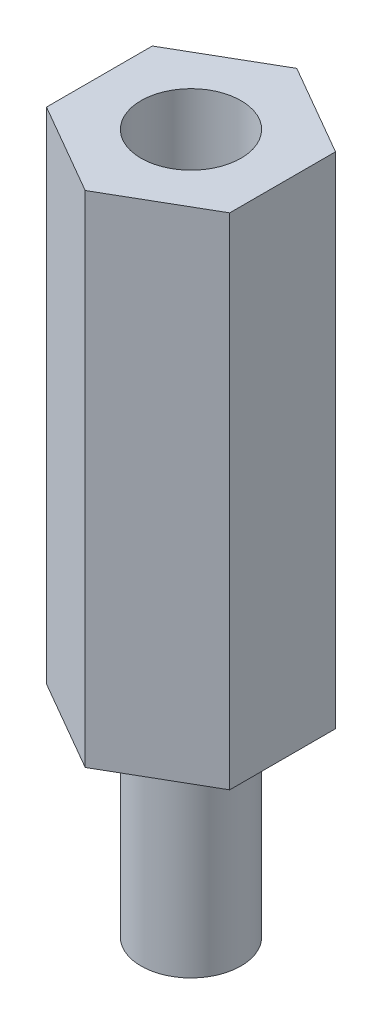
ISO-10303-21;
HEADER;
FILE_DESCRIPTION(('STEP AP214'),'2;1');
FILE_NAME('part.step','',(''),(''),'','','');
FILE_SCHEMA(('AUTOMOTIVE_DESIGN { 1 0 10303 214 1 1 1 1 }'));
ENDSEC;
DATA;
#1=APPLICATION_CONTEXT('core data for automotive mechanical design processes');
#2=APPLICATION_PROTOCOL_DEFINITION('international standard','automotive_design',2000,#1);
#3=PRODUCT_CONTEXT('',#1,'mechanical');
#4=PRODUCT('Part','Part','',(#3));
#5=PRODUCT_RELATED_PRODUCT_CATEGORY('part','',(#4));
#6=PRODUCT_DEFINITION_FORMATION('','',#4);
#7=PRODUCT_DEFINITION_CONTEXT('part definition',#1,'design');
#8=PRODUCT_DEFINITION('design','',#6,#7);
#9=PRODUCT_DEFINITION_SHAPE('','',#8);
#10=(LENGTH_UNIT() NAMED_UNIT(*) SI_UNIT(.MILLI.,.METRE.));
#11=(NAMED_UNIT(*) PLANE_ANGLE_UNIT() SI_UNIT($,.RADIAN.));
#12=(NAMED_UNIT(*) SI_UNIT($,.STERADIAN.) SOLID_ANGLE_UNIT());
#13=UNCERTAINTY_MEASURE_WITH_UNIT(LENGTH_MEASURE(1.E-05),#10,'distance_accuracy_value','');
#14=(GEOMETRIC_REPRESENTATION_CONTEXT(3) GLOBAL_UNCERTAINTY_ASSIGNED_CONTEXT((#13)) GLOBAL_UNIT_ASSIGNED_CONTEXT((#10,
#11,#12)) REPRESENTATION_CONTEXT('',''));
#15=CARTESIAN_POINT('',(0.,0.,0.));
#16=DIRECTION('',(0.,0.,1.));
#17=DIRECTION('',(1.,0.,0.));
#18=AXIS2_PLACEMENT_3D('',#15,#16,#17);
#19=CARTESIAN_POINT('',(2.74999999999998,15.,-1.5877132402715));
#20=DIRECTION('',(-0.499999999999995,0.,0.866025403784441));
#21=DIRECTION('',(0.866025403784441,0.,0.499999999999995));
#22=AXIS2_PLACEMENT_3D('',#19,#20,#21);
#23=PLANE('',#22);
#24=DIRECTION('',(-0.866025403784441,0.,-0.499999999999995));
#25=VECTOR('',#24,1.);
#26=CARTESIAN_POINT('',(2.74999999999998,0.,-1.5877132402715));
#27=LINE('',#26,#25);
#28=CARTESIAN_POINT('',(2.74999999999998,0.,-1.5877132402715));
#29=VERTEX_POINT('',#28);
#30=CARTESIAN_POINT('',(0.,0.,-3.17542648054294));
#31=VERTEX_POINT('',#30);
#32=EDGE_CURVE('E120',#29,#31,#27,.T.);
#33=ORIENTED_EDGE('',*,*,#32,.T.);
#34=DIRECTION('',(0.,-1.,0.));
#35=VECTOR('',#34,1.);
#36=CARTESIAN_POINT('',(0.,15.,-3.17542648054294));
#37=LINE('',#36,#35);
#38=CARTESIAN_POINT('',(0.,15.,-3.17542648054294));
#39=VERTEX_POINT('',#38);
#40=EDGE_CURVE('E37',#39,#31,#37,.T.);
#41=ORIENTED_EDGE('',*,*,#40,.F.);
#42=DIRECTION('',(-0.866025403784441,0.,-0.499999999999995));
#43=VECTOR('',#42,1.);
#44=CARTESIAN_POINT('',(2.74999999999998,15.,-1.5877132402715));
#45=LINE('',#44,#43);
#46=CARTESIAN_POINT('',(2.74999999999998,15.,-1.5877132402715));
#47=VERTEX_POINT('',#46);
#48=EDGE_CURVE('E131',#47,#39,#45,.T.);
#49=ORIENTED_EDGE('',*,*,#48,.F.);
#50=DIRECTION('',(0.,-1.,0.));
#51=VECTOR('',#50,1.);
#52=CARTESIAN_POINT('',(2.74999999999998,15.,-1.5877132402715));
#53=LINE('',#52,#51);
#54=EDGE_CURVE('E116',#47,#29,#53,.T.);
#55=ORIENTED_EDGE('',*,*,#54,.T.);
#56=EDGE_LOOP('',(#33,#41,#49,#55));
#57=FACE_BOUND('',#56,.T.);
#58=ADVANCED_FACE('F34',(#57),#23,.F.);
#59=CARTESIAN_POINT('',(0.,15.,-3.17542648054294));
#60=DIRECTION('',(0.500000000000001,0.,0.866025403784438));
#61=DIRECTION('',(0.866025403784438,0.,-0.500000000000001));
#62=AXIS2_PLACEMENT_3D('',#59,#60,#61);
#63=PLANE('',#62);
#64=DIRECTION('',(-0.866025403784438,0.,0.500000000000001));
#65=VECTOR('',#64,1.);
#66=CARTESIAN_POINT('',(0.,0.,-3.17542648054294));
#67=LINE('',#66,#65);
#68=CARTESIAN_POINT('',(-2.75,0.,-1.58771324027146));
#69=VERTEX_POINT('',#68);
#70=EDGE_CURVE('E123',#31,#69,#67,.T.);
#71=ORIENTED_EDGE('',*,*,#70,.T.);
#72=DIRECTION('',(0.,-1.,0.));
#73=VECTOR('',#72,1.);
#74=CARTESIAN_POINT('',(-2.75,15.,-1.58771324027146));
#75=LINE('',#74,#73);
#76=CARTESIAN_POINT('',(-2.75,15.,-1.58771324027146));
#77=VERTEX_POINT('',#76);
#78=EDGE_CURVE('E134',#77,#69,#75,.T.);
#79=ORIENTED_EDGE('',*,*,#78,.F.);
#80=DIRECTION('',(-0.866025403784438,0.,0.500000000000001));
#81=VECTOR('',#80,1.);
#82=CARTESIAN_POINT('',(0.,15.,-3.17542648054294));
#83=LINE('',#82,#81);
#84=EDGE_CURVE('E89',#39,#77,#83,.T.);
#85=ORIENTED_EDGE('',*,*,#84,.F.);
#86=ORIENTED_EDGE('',*,*,#40,.T.);
#87=EDGE_LOOP('',(#71,#79,#85,#86));
#88=FACE_BOUND('',#87,.T.);
#89=ADVANCED_FACE('F139',(#88),#63,.F.);
#90=CARTESIAN_POINT('',(-2.75,15.,-1.58771324027146));
#91=DIRECTION('',(1.,0.,0.));
#92=DIRECTION('',(0.,0.,-1.));
#93=AXIS2_PLACEMENT_3D('',#90,#91,#92);
#94=PLANE('',#93);
#95=DIRECTION('',(0.,0.,1.));
#96=VECTOR('',#95,1.);
#97=CARTESIAN_POINT('',(-2.75,0.,-1.58771324027146));
#98=LINE('',#97,#96);
#99=CARTESIAN_POINT('',(-2.74999999999999,0.,1.58771324027148));
#100=VERTEX_POINT('',#99);
#101=EDGE_CURVE('E126',#69,#100,#98,.T.);
#102=ORIENTED_EDGE('',*,*,#101,.T.);
#103=DIRECTION('',(0.,-1.,0.));
#104=VECTOR('',#103,1.);
#105=CARTESIAN_POINT('',(-2.74999999999999,15.,1.58771324027148));
#106=LINE('',#105,#104);
#107=CARTESIAN_POINT('',(-2.74999999999999,15.,1.58771324027148));
#108=VERTEX_POINT('',#107);
#109=EDGE_CURVE('E111',#108,#100,#106,.T.);
#110=ORIENTED_EDGE('',*,*,#109,.F.);
#111=DIRECTION('',(0.,0.,1.));
#112=VECTOR('',#111,1.);
#113=CARTESIAN_POINT('',(-2.75,15.,-1.58771324027146));
#114=LINE('',#113,#112);
#115=EDGE_CURVE('E102',#77,#108,#114,.T.);
#116=ORIENTED_EDGE('',*,*,#115,.F.);
#117=ORIENTED_EDGE('',*,*,#78,.T.);
#118=EDGE_LOOP('',(#102,#110,#116,#117));
#119=FACE_BOUND('',#118,.T.);
#120=ADVANCED_FACE('F145',(#119),#94,.F.);
#121=CARTESIAN_POINT('',(-2.74999999999999,15.,1.58771324027148));
#122=DIRECTION('',(0.499999999999995,0.,-0.866025403784442));
#123=DIRECTION('',(-0.866025403784442,0.,-0.499999999999995));
#124=AXIS2_PLACEMENT_3D('',#121,#122,#123);
#125=PLANE('',#124);
#126=DIRECTION('',(0.866025403784442,0.,0.499999999999995));
#127=VECTOR('',#126,1.);
#128=CARTESIAN_POINT('',(-2.74999999999999,0.,1.58771324027148));
#129=LINE('',#128,#127);
#130=CARTESIAN_POINT('',(0.,0.,3.17542648054294));
#131=VERTEX_POINT('',#130);
#132=EDGE_CURVE('E110',#100,#131,#129,.T.);
#133=ORIENTED_EDGE('',*,*,#132,.T.);
#134=DIRECTION('',(0.,-1.,0.));
#135=VECTOR('',#134,1.);
#136=CARTESIAN_POINT('',(0.,15.,3.17542648054294));
#137=LINE('',#136,#135);
#138=CARTESIAN_POINT('',(0.,15.,3.17542648054294));
#139=VERTEX_POINT('',#138);
#140=EDGE_CURVE('E107',#139,#131,#137,.T.);
#141=ORIENTED_EDGE('',*,*,#140,.F.);
#142=DIRECTION('',(0.866025403784442,0.,0.499999999999995));
#143=VECTOR('',#142,1.);
#144=CARTESIAN_POINT('',(-2.74999999999999,15.,1.58771324027148));
#145=LINE('',#144,#143);
#146=EDGE_CURVE('E96',#108,#139,#145,.T.);
#147=ORIENTED_EDGE('',*,*,#146,.F.);
#148=ORIENTED_EDGE('',*,*,#109,.T.);
#149=EDGE_LOOP('',(#133,#141,#147,#148));
#150=FACE_BOUND('',#149,.T.);
#151=ADVANCED_FACE('F108',(#150),#125,.F.);
#152=CARTESIAN_POINT('',(0.,15.,3.17542648054294));
#153=DIRECTION('',(-0.500000000000007,0.,-0.866025403784435));
#154=DIRECTION('',(-0.866025403784435,0.,0.500000000000007));
#155=AXIS2_PLACEMENT_3D('',#152,#153,#154);
#156=PLANE('',#155);
#157=DIRECTION('',(0.866025403784434,0.,-0.500000000000007));
#158=VECTOR('',#157,1.);
#159=CARTESIAN_POINT('',(0.,0.,3.17542648054294));
#160=LINE('',#159,#158);
#161=CARTESIAN_POINT('',(2.75000000000001,0.,1.58771324027144));
#162=VERTEX_POINT('',#161);
#163=EDGE_CURVE('E74',#131,#162,#160,.T.);
#164=ORIENTED_EDGE('',*,*,#163,.T.);
#165=DIRECTION('',(0.,-1.,0.));
#166=VECTOR('',#165,1.);
#167=CARTESIAN_POINT('',(2.75000000000001,15.,1.58771324027144));
#168=LINE('',#167,#166);
#169=CARTESIAN_POINT('',(2.75000000000001,15.,1.58771324027144));
#170=VERTEX_POINT('',#169);
#171=EDGE_CURVE('E112',#170,#162,#168,.T.);
#172=ORIENTED_EDGE('',*,*,#171,.F.);
#173=DIRECTION('',(0.866025403784434,0.,-0.500000000000007));
#174=VECTOR('',#173,1.);
#175=CARTESIAN_POINT('',(0.,15.,3.17542648054294));
#176=LINE('',#175,#174);
#177=EDGE_CURVE('E100',#139,#170,#176,.T.);
#178=ORIENTED_EDGE('',*,*,#177,.F.);
#179=ORIENTED_EDGE('',*,*,#140,.T.);
#180=EDGE_LOOP('',(#164,#172,#178,#179));
#181=FACE_BOUND('',#180,.T.);
#182=ADVANCED_FACE('F114',(#181),#156,.F.);
#183=CARTESIAN_POINT('',(2.75000000000001,15.,1.58771324027144));
#184=DIRECTION('',(-1.,0.,0.));
#185=DIRECTION('',(0.,0.,1.));
#186=AXIS2_PLACEMENT_3D('',#183,#184,#185);
#187=PLANE('',#186);
#188=DIRECTION('',(0.,0.,-1.));
#189=VECTOR('',#188,1.);
#190=CARTESIAN_POINT('',(2.75000000000001,0.,1.58771324027144));
#191=LINE('',#190,#189);
#192=EDGE_CURVE('E80',#162,#29,#191,.T.);
#193=ORIENTED_EDGE('',*,*,#192,.T.);
#194=ORIENTED_EDGE('',*,*,#54,.F.);
#195=DIRECTION('',(0.,0.,-1.));
#196=VECTOR('',#195,1.);
#197=CARTESIAN_POINT('',(2.75000000000001,15.,1.58771324027144));
#198=LINE('',#197,#196);
#199=EDGE_CURVE('E51',#170,#47,#198,.T.);
#200=ORIENTED_EDGE('',*,*,#199,.F.);
#201=ORIENTED_EDGE('',*,*,#171,.T.);
#202=EDGE_LOOP('',(#193,#194,#200,#201));
#203=FACE_BOUND('',#202,.T.);
#204=ADVANCED_FACE('F168',(#203),#187,.F.);
#205=CARTESIAN_POINT('',(0.,15.,0.));
#206=DIRECTION('',(0.,1.,0.));
#207=DIRECTION('',(0.,0.,1.));
#208=AXIS2_PLACEMENT_3D('',#205,#206,#207);
#209=PLANE('',#208);
#210=CARTESIAN_POINT('',(0.,15.,0.));
#211=DIRECTION('',(0.,1.,0.));
#212=DIRECTION('',(0.,0.,1.));
#213=AXIS2_PLACEMENT_3D('',#210,#211,#212);
#214=CIRCLE('',#213,1.5);
#215=CARTESIAN_POINT('',(0.,15.,1.5));
#216=VERTEX_POINT('',#215);
#217=EDGE_CURVE('E152',#216,#216,#214,.T.);
#218=ORIENTED_EDGE('',*,*,#217,.F.);
#219=EDGE_LOOP('',(#218));
#220=FACE_BOUND('',#219,.T.);
#221=ORIENTED_EDGE('',*,*,#48,.T.);
#222=ORIENTED_EDGE('',*,*,#84,.T.);
#223=ORIENTED_EDGE('',*,*,#115,.T.);
#224=ORIENTED_EDGE('',*,*,#146,.T.);
#225=ORIENTED_EDGE('',*,*,#177,.T.);
#226=ORIENTED_EDGE('',*,*,#199,.T.);
#227=EDGE_LOOP('',(#221,#222,#223,#224,#225,#226));
#228=FACE_BOUND('',#227,.T.);
#229=ADVANCED_FACE('F98',(#220,#228),#209,.T.);
#230=CARTESIAN_POINT('',(0.,0.,0.));
#231=DIRECTION('',(0.,1.,0.));
#232=DIRECTION('',(0.,0.,1.));
#233=AXIS2_PLACEMENT_3D('',#230,#231,#232);
#234=PLANE('',#233);
#235=CARTESIAN_POINT('',(0.,0.,0.));
#236=DIRECTION('',(0.,-1.,0.));
#237=DIRECTION('',(0.,0.,-1.));
#238=AXIS2_PLACEMENT_3D('',#235,#236,#237);
#239=CIRCLE('',#238,1.5);
#240=CARTESIAN_POINT('',(0.,0.,-1.5));
#241=VERTEX_POINT('',#240);
#242=EDGE_CURVE('E11',#241,#241,#239,.T.);
#243=ORIENTED_EDGE('',*,*,#242,.F.);
#244=EDGE_LOOP('',(#243));
#245=FACE_BOUND('',#244,.T.);
#246=ORIENTED_EDGE('',*,*,#32,.F.);
#247=ORIENTED_EDGE('',*,*,#192,.F.);
#248=ORIENTED_EDGE('',*,*,#163,.F.);
#249=ORIENTED_EDGE('',*,*,#132,.F.);
#250=ORIENTED_EDGE('',*,*,#101,.F.);
#251=ORIENTED_EDGE('',*,*,#70,.F.);
#252=EDGE_LOOP('',(#246,#247,#248,#249,#250,#251));
#253=FACE_BOUND('',#252,.T.);
#254=ADVANCED_FACE('F144',(#245,#253),#234,.F.);
#255=CARTESIAN_POINT('',(0.,-6.,0.));
#256=DIRECTION('',(0.,1.,0.));
#257=DIRECTION('',(0.,0.,1.));
#258=AXIS2_PLACEMENT_3D('',#255,#256,#257);
#259=CYLINDRICAL_SURFACE('',#258,1.5);
#260=CARTESIAN_POINT('',(0.,-6.,0.));
#261=DIRECTION('',(0.,-1.,0.));
#262=DIRECTION('',(0.,0.,-1.));
#263=AXIS2_PLACEMENT_3D('',#260,#261,#262);
#264=CIRCLE('',#263,1.5);
#265=CARTESIAN_POINT('',(0.,-6.,-1.5));
#266=VERTEX_POINT('',#265);
#267=EDGE_CURVE('E124',#266,#266,#264,.T.);
#268=ORIENTED_EDGE('',*,*,#267,.F.);
#269=EDGE_LOOP('',(#268));
#270=FACE_BOUND('',#269,.T.);
#271=ORIENTED_EDGE('',*,*,#242,.T.);
#272=EDGE_LOOP('',(#271));
#273=FACE_BOUND('',#272,.T.);
#274=ADVANCED_FACE('F174',(#270,#273),#259,.T.);
#275=CARTESIAN_POINT('',(0.,-6.,0.));
#276=DIRECTION('',(0.,-1.,0.));
#277=DIRECTION('',(0.,0.,-1.));
#278=AXIS2_PLACEMENT_3D('',#275,#276,#277);
#279=PLANE('',#278);
#280=ORIENTED_EDGE('',*,*,#267,.T.);
#281=EDGE_LOOP('',(#280));
#282=FACE_BOUND('',#281,.T.);
#283=ADVANCED_FACE('F163',(#282),#279,.T.);
#284=CARTESIAN_POINT('',(0.,9.,0.));
#285=DIRECTION('',(0.,1.,0.));
#286=DIRECTION('',(0.,0.,1.));
#287=AXIS2_PLACEMENT_3D('',#284,#285,#286);
#288=CYLINDRICAL_SURFACE('',#287,1.5);
#289=CARTESIAN_POINT('',(0.,9.,0.));
#290=DIRECTION('',(0.,1.,0.));
#291=DIRECTION('',(0.,0.,1.));
#292=AXIS2_PLACEMENT_3D('',#289,#290,#291);
#293=CIRCLE('',#292,1.5);
#294=CARTESIAN_POINT('',(0.,9.,1.5));
#295=VERTEX_POINT('',#294);
#296=EDGE_CURVE('E151',#295,#295,#293,.T.);
#297=ORIENTED_EDGE('',*,*,#296,.F.);
#298=EDGE_LOOP('',(#297));
#299=FACE_BOUND('',#298,.T.);
#300=ORIENTED_EDGE('',*,*,#217,.T.);
#301=EDGE_LOOP('',(#300));
#302=FACE_BOUND('',#301,.T.);
#303=ADVANCED_FACE('F160',(#299,#302),#288,.F.);
#304=CARTESIAN_POINT('',(0.,9.,0.));
#305=DIRECTION('',(0.,1.,0.));
#306=DIRECTION('',(0.,0.,1.));
#307=AXIS2_PLACEMENT_3D('',#304,#305,#306);
#308=PLANE('',#307);
#309=ORIENTED_EDGE('',*,*,#296,.T.);
#310=EDGE_LOOP('',(#309));
#311=FACE_BOUND('',#310,.T.);
#312=ADVANCED_FACE('F158',(#311),#308,.T.);
#313=CLOSED_SHELL('',(#58,#89,#120,#151,#182,#204,#229,#254,#274,#283,#303,#312));
#314=MANIFOLD_SOLID_BREP('B2',#313);
#315=ADVANCED_BREP_SHAPE_REPRESENTATION('',(#18,#314),#14);
#316=SHAPE_DEFINITION_REPRESENTATION(#9,#315);
ENDSEC;
END-ISO-10303-21;
